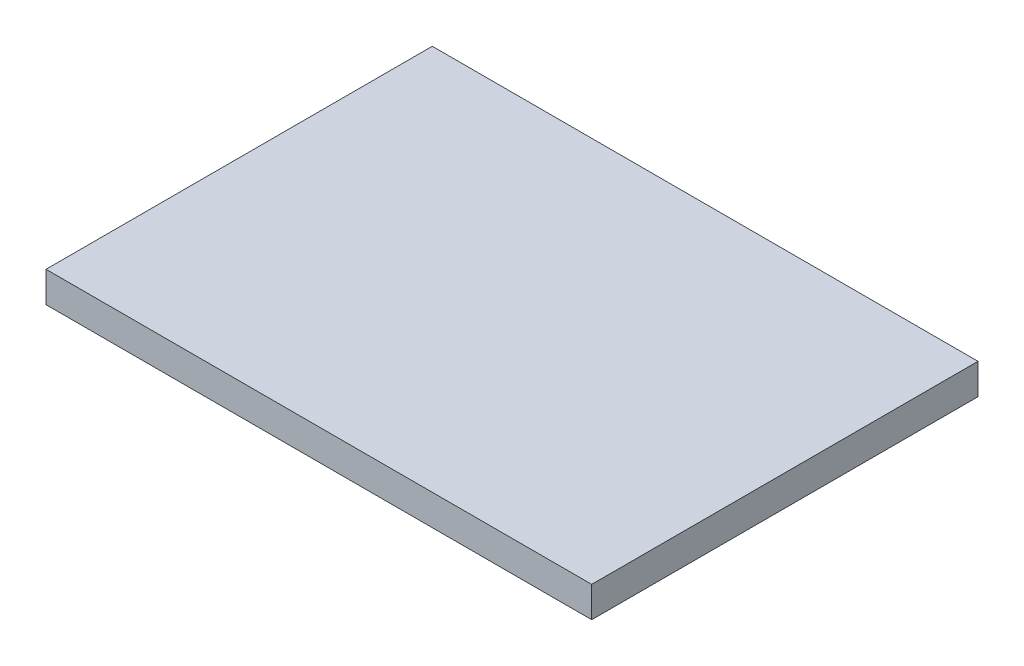
ISO-10303-21;
HEADER;
FILE_DESCRIPTION(('STEP AP214'),'2;1');
FILE_NAME('part.step','',(''),(''),'','','');
FILE_SCHEMA(('AUTOMOTIVE_DESIGN { 1 0 10303 214 1 1 1 1 }'));
ENDSEC;
DATA;
#1=APPLICATION_CONTEXT('core data for automotive mechanical design processes');
#2=APPLICATION_PROTOCOL_DEFINITION('international standard','automotive_design',2000,#1);
#3=PRODUCT_CONTEXT('',#1,'mechanical');
#4=PRODUCT('Part','Part','',(#3));
#5=PRODUCT_RELATED_PRODUCT_CATEGORY('part','',(#4));
#6=PRODUCT_DEFINITION_FORMATION('','',#4);
#7=PRODUCT_DEFINITION_CONTEXT('part definition',#1,'design');
#8=PRODUCT_DEFINITION('design','',#6,#7);
#9=PRODUCT_DEFINITION_SHAPE('','',#8);
#10=(LENGTH_UNIT() NAMED_UNIT(*) SI_UNIT(.MILLI.,.METRE.));
#11=(NAMED_UNIT(*) PLANE_ANGLE_UNIT() SI_UNIT($,.RADIAN.));
#12=(NAMED_UNIT(*) SI_UNIT($,.STERADIAN.) SOLID_ANGLE_UNIT());
#13=UNCERTAINTY_MEASURE_WITH_UNIT(LENGTH_MEASURE(1.E-05),#10,'distance_accuracy_value','');
#14=(GEOMETRIC_REPRESENTATION_CONTEXT(3) GLOBAL_UNCERTAINTY_ASSIGNED_CONTEXT((#13)) GLOBAL_UNIT_ASSIGNED_CONTEXT((#10,
#11,#12)) REPRESENTATION_CONTEXT('',''));
#15=CARTESIAN_POINT('',(0.,0.,0.));
#16=DIRECTION('',(0.,0.,1.));
#17=DIRECTION('',(1.,0.,0.));
#18=AXIS2_PLACEMENT_3D('',#15,#16,#17);
#19=CARTESIAN_POINT('',(17.8,2.,12.6));
#20=DIRECTION('',(-1.,0.,0.));
#21=DIRECTION('',(0.,0.,1.));
#22=AXIS2_PLACEMENT_3D('',#19,#20,#21);
#23=PLANE('',#22);
#24=DIRECTION('',(0.,0.,-1.));
#25=VECTOR('',#24,1.);
#26=CARTESIAN_POINT('',(17.8,0.,12.6));
#27=LINE('',#26,#25);
#28=CARTESIAN_POINT('',(17.8,0.,12.6));
#29=VERTEX_POINT('',#28);
#30=CARTESIAN_POINT('',(17.8,0.,-12.6));
#31=VERTEX_POINT('',#30);
#32=EDGE_CURVE('E107',#29,#31,#27,.T.);
#33=ORIENTED_EDGE('',*,*,#32,.T.);
#34=DIRECTION('',(0.,-1.,0.));
#35=VECTOR('',#34,1.);
#36=CARTESIAN_POINT('',(17.8,2.,-12.6));
#37=LINE('',#36,#35);
#38=CARTESIAN_POINT('',(17.8,2.,-12.6));
#39=VERTEX_POINT('',#38);
#40=EDGE_CURVE('E11',#39,#31,#37,.T.);
#41=ORIENTED_EDGE('',*,*,#40,.F.);
#42=DIRECTION('',(0.,0.,-1.));
#43=VECTOR('',#42,1.);
#44=CARTESIAN_POINT('',(17.8,2.,12.6));
#45=LINE('',#44,#43);
#46=CARTESIAN_POINT('',(17.8,2.,12.6));
#47=VERTEX_POINT('',#46);
#48=EDGE_CURVE('E91',#47,#39,#45,.T.);
#49=ORIENTED_EDGE('',*,*,#48,.F.);
#50=DIRECTION('',(0.,-1.,0.));
#51=VECTOR('',#50,1.);
#52=CARTESIAN_POINT('',(17.8,2.,12.6));
#53=LINE('',#52,#51);
#54=EDGE_CURVE('E103',#47,#29,#53,.T.);
#55=ORIENTED_EDGE('',*,*,#54,.T.);
#56=EDGE_LOOP('',(#33,#41,#49,#55));
#57=FACE_BOUND('',#56,.T.);
#58=ADVANCED_FACE('F39',(#57),#23,.F.);
#59=CARTESIAN_POINT('',(-17.8,2.,-12.6));
#60=DIRECTION('',(0.,0.,1.));
#61=DIRECTION('',(1.,0.,0.));
#62=AXIS2_PLACEMENT_3D('',#59,#60,#61);
#63=PLANE('',#62);
#64=DIRECTION('',(-1.,0.,0.));
#65=VECTOR('',#64,1.);
#66=CARTESIAN_POINT('',(-17.8,0.,-12.6));
#67=LINE('',#66,#65);
#68=CARTESIAN_POINT('',(-17.8,0.,-12.6));
#69=VERTEX_POINT('',#68);
#70=EDGE_CURVE('E96',#31,#69,#67,.T.);
#71=ORIENTED_EDGE('',*,*,#70,.T.);
#72=DIRECTION('',(0.,-1.,0.));
#73=VECTOR('',#72,1.);
#74=CARTESIAN_POINT('',(-17.8,2.,-12.6));
#75=LINE('',#74,#73);
#76=CARTESIAN_POINT('',(-17.8,2.,-12.6));
#77=VERTEX_POINT('',#76);
#78=EDGE_CURVE('E48',#77,#69,#75,.T.);
#79=ORIENTED_EDGE('',*,*,#78,.F.);
#80=DIRECTION('',(-1.,0.,0.));
#81=VECTOR('',#80,1.);
#82=CARTESIAN_POINT('',(-17.8,2.,-12.6));
#83=LINE('',#82,#81);
#84=EDGE_CURVE('E86',#39,#77,#83,.T.);
#85=ORIENTED_EDGE('',*,*,#84,.F.);
#86=ORIENTED_EDGE('',*,*,#40,.T.);
#87=EDGE_LOOP('',(#71,#79,#85,#86));
#88=FACE_BOUND('',#87,.T.);
#89=ADVANCED_FACE('F95',(#88),#63,.F.);
#90=CARTESIAN_POINT('',(-17.8,2.,12.6));
#91=DIRECTION('',(1.,0.,0.));
#92=DIRECTION('',(0.,0.,-1.));
#93=AXIS2_PLACEMENT_3D('',#90,#91,#92);
#94=PLANE('',#93);
#95=DIRECTION('',(0.,0.,1.));
#96=VECTOR('',#95,1.);
#97=CARTESIAN_POINT('',(-17.8,0.,12.6));
#98=LINE('',#97,#96);
#99=CARTESIAN_POINT('',(-17.8,0.,12.6));
#100=VERTEX_POINT('',#99);
#101=EDGE_CURVE('E73',#69,#100,#98,.T.);
#102=ORIENTED_EDGE('',*,*,#101,.T.);
#103=DIRECTION('',(0.,-1.,0.));
#104=VECTOR('',#103,1.);
#105=CARTESIAN_POINT('',(-17.8,2.,12.6));
#106=LINE('',#105,#104);
#107=CARTESIAN_POINT('',(-17.8,2.,12.6));
#108=VERTEX_POINT('',#107);
#109=EDGE_CURVE('E98',#108,#100,#106,.T.);
#110=ORIENTED_EDGE('',*,*,#109,.F.);
#111=DIRECTION('',(0.,0.,1.));
#112=VECTOR('',#111,1.);
#113=CARTESIAN_POINT('',(-17.8,2.,12.6));
#114=LINE('',#113,#112);
#115=EDGE_CURVE('E89',#77,#108,#114,.T.);
#116=ORIENTED_EDGE('',*,*,#115,.F.);
#117=ORIENTED_EDGE('',*,*,#78,.T.);
#118=EDGE_LOOP('',(#102,#110,#116,#117));
#119=FACE_BOUND('',#118,.T.);
#120=ADVANCED_FACE('F99',(#119),#94,.F.);
#121=CARTESIAN_POINT('',(-17.8,2.,12.6));
#122=DIRECTION('',(0.,0.,-1.));
#123=DIRECTION('',(-1.,0.,0.));
#124=AXIS2_PLACEMENT_3D('',#121,#122,#123);
#125=PLANE('',#124);
#126=DIRECTION('',(1.,0.,0.));
#127=VECTOR('',#126,1.);
#128=CARTESIAN_POINT('',(-17.8,0.,12.6));
#129=LINE('',#128,#127);
#130=EDGE_CURVE('E79',#100,#29,#129,.T.);
#131=ORIENTED_EDGE('',*,*,#130,.T.);
#132=ORIENTED_EDGE('',*,*,#54,.F.);
#133=DIRECTION('',(1.,0.,0.));
#134=VECTOR('',#133,1.);
#135=CARTESIAN_POINT('',(-17.8,2.,12.6));
#136=LINE('',#135,#134);
#137=EDGE_CURVE('E56',#108,#47,#136,.T.);
#138=ORIENTED_EDGE('',*,*,#137,.F.);
#139=ORIENTED_EDGE('',*,*,#109,.T.);
#140=EDGE_LOOP('',(#131,#132,#138,#139));
#141=FACE_BOUND('',#140,.T.);
#142=ADVANCED_FACE('F120',(#141),#125,.F.);
#143=CARTESIAN_POINT('',(0.,2.,0.));
#144=DIRECTION('',(0.,-1.,0.));
#145=DIRECTION('',(0.,0.,-1.));
#146=AXIS2_PLACEMENT_3D('',#143,#144,#145);
#147=PLANE('',#146);
#148=ORIENTED_EDGE('',*,*,#48,.T.);
#149=ORIENTED_EDGE('',*,*,#84,.T.);
#150=ORIENTED_EDGE('',*,*,#115,.T.);
#151=ORIENTED_EDGE('',*,*,#137,.T.);
#152=EDGE_LOOP('',(#148,#149,#150,#151));
#153=FACE_BOUND('',#152,.T.);
#154=ADVANCED_FACE('F87',(#153),#147,.F.);
#155=CARTESIAN_POINT('',(0.,0.,0.));
#156=DIRECTION('',(0.,-1.,0.));
#157=DIRECTION('',(0.,0.,-1.));
#158=AXIS2_PLACEMENT_3D('',#155,#156,#157);
#159=PLANE('',#158);
#160=ORIENTED_EDGE('',*,*,#32,.F.);
#161=ORIENTED_EDGE('',*,*,#130,.F.);
#162=ORIENTED_EDGE('',*,*,#101,.F.);
#163=ORIENTED_EDGE('',*,*,#70,.F.);
#164=EDGE_LOOP('',(#160,#161,#162,#163));
#165=FACE_BOUND('',#164,.T.);
#166=ADVANCED_FACE('F123',(#165),#159,.T.);
#167=CLOSED_SHELL('',(#58,#89,#120,#142,#154,#166));
#168=MANIFOLD_SOLID_BREP('B2',#167);
#169=ADVANCED_BREP_SHAPE_REPRESENTATION('',(#18,#168),#14);
#170=SHAPE_DEFINITION_REPRESENTATION(#9,#169);
ENDSEC;
END-ISO-10303-21;
